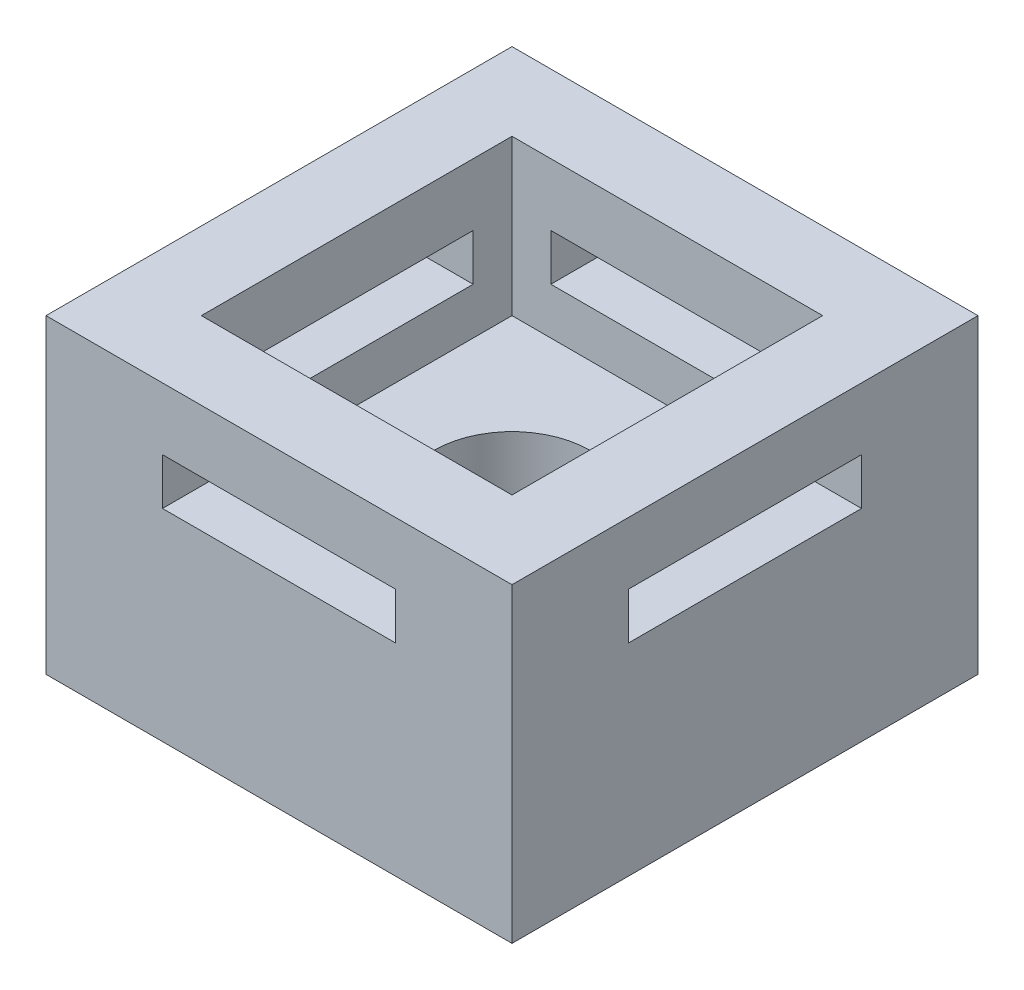
ISO-10303-21;
HEADER;
FILE_DESCRIPTION(('STEP AP214'),'2;1');
FILE_NAME('part.step','',(''),(''),'','','');
FILE_SCHEMA(('AUTOMOTIVE_DESIGN { 1 0 10303 214 1 1 1 1 }'));
ENDSEC;
DATA;
#1=APPLICATION_CONTEXT('core data for automotive mechanical design processes');
#2=APPLICATION_PROTOCOL_DEFINITION('international standard','automotive_design',2000,#1);
#3=PRODUCT_CONTEXT('',#1,'mechanical');
#4=PRODUCT('Part','Part','',(#3));
#5=PRODUCT_RELATED_PRODUCT_CATEGORY('part','',(#4));
#6=PRODUCT_DEFINITION_FORMATION('','',#4);
#7=PRODUCT_DEFINITION_CONTEXT('part definition',#1,'design');
#8=PRODUCT_DEFINITION('design','',#6,#7);
#9=PRODUCT_DEFINITION_SHAPE('','',#8);
#10=(LENGTH_UNIT() NAMED_UNIT(*) SI_UNIT(.MILLI.,.METRE.));
#11=(NAMED_UNIT(*) PLANE_ANGLE_UNIT() SI_UNIT($,.RADIAN.));
#12=(NAMED_UNIT(*) SI_UNIT($,.STERADIAN.) SOLID_ANGLE_UNIT());
#13=UNCERTAINTY_MEASURE_WITH_UNIT(LENGTH_MEASURE(1.E-05),#10,'distance_accuracy_value','');
#14=(GEOMETRIC_REPRESENTATION_CONTEXT(3) GLOBAL_UNCERTAINTY_ASSIGNED_CONTEXT((#13)) GLOBAL_UNIT_ASSIGNED_CONTEXT((#10,
#11,#12)) REPRESENTATION_CONTEXT('',''));
#15=CARTESIAN_POINT('',(0.,0.,0.));
#16=DIRECTION('',(0.,0.,1.));
#17=DIRECTION('',(1.,0.,0.));
#18=AXIS2_PLACEMENT_3D('',#15,#16,#17);
#19=CARTESIAN_POINT('',(7.62,10.16,-7.62));
#20=DIRECTION('',(0.,-1.,0.));
#21=DIRECTION('',(0.,0.,-1.));
#22=AXIS2_PLACEMENT_3D('',#19,#20,#21);
#23=CYLINDRICAL_SURFACE('',#22,2.54);
#24=CARTESIAN_POINT('',(7.62,0.,-7.62));
#25=DIRECTION('',(0.,1.,0.));
#26=DIRECTION('',(0.,0.,1.));
#27=AXIS2_PLACEMENT_3D('',#24,#25,#26);
#28=CIRCLE('',#27,2.54);
#29=CARTESIAN_POINT('',(7.62,0.,-5.08));
#30=VERTEX_POINT('',#29);
#31=EDGE_CURVE('E333',#30,#30,#28,.T.);
#32=ORIENTED_EDGE('',*,*,#31,.F.);
#33=EDGE_LOOP('',(#32));
#34=FACE_BOUND('',#33,.T.);
#35=CARTESIAN_POINT('',(7.62,5.08,-7.62));
#36=DIRECTION('',(0.,1.,0.));
#37=DIRECTION('',(0.,0.,1.));
#38=AXIS2_PLACEMENT_3D('',#35,#36,#37);
#39=CIRCLE('',#38,2.54);
#40=CARTESIAN_POINT('',(7.62,5.08,-5.08));
#41=VERTEX_POINT('',#40);
#42=EDGE_CURVE('E326',#41,#41,#39,.T.);
#43=ORIENTED_EDGE('',*,*,#42,.T.);
#44=EDGE_LOOP('',(#43));
#45=FACE_BOUND('',#44,.T.);
#46=ADVANCED_FACE('F33',(#34,#45),#23,.F.);
#47=CARTESIAN_POINT('',(0.,10.16,0.));
#48=DIRECTION('',(0.,-1.,0.));
#49=DIRECTION('',(0.,0.,-1.));
#50=AXIS2_PLACEMENT_3D('',#47,#48,#49);
#51=PLANE('',#50);
#52=DIRECTION('',(1.,0.,0.));
#53=VECTOR('',#52,1.);
#54=CARTESIAN_POINT('',(2.54,10.16,-2.54));
#55=LINE('',#54,#53);
#56=CARTESIAN_POINT('',(2.54,10.16,-2.54));
#57=VERTEX_POINT('',#56);
#58=CARTESIAN_POINT('',(12.7,10.16,-2.54));
#59=VERTEX_POINT('',#58);
#60=EDGE_CURVE('E316',#57,#59,#55,.T.);
#61=ORIENTED_EDGE('',*,*,#60,.F.);
#62=DIRECTION('',(0.,0.,1.));
#63=VECTOR('',#62,1.);
#64=CARTESIAN_POINT('',(2.54,10.16,-12.7));
#65=LINE('',#64,#63);
#66=CARTESIAN_POINT('',(2.54,10.16,-12.7));
#67=VERTEX_POINT('',#66);
#68=EDGE_CURVE('E300',#67,#57,#65,.T.);
#69=ORIENTED_EDGE('',*,*,#68,.F.);
#70=DIRECTION('',(-1.,0.,0.));
#71=VECTOR('',#70,1.);
#72=CARTESIAN_POINT('',(2.54,10.16,-12.7));
#73=LINE('',#72,#71);
#74=CARTESIAN_POINT('',(12.7,10.16,-12.7));
#75=VERTEX_POINT('',#74);
#76=EDGE_CURVE('E305',#75,#67,#73,.T.);
#77=ORIENTED_EDGE('',*,*,#76,.F.);
#78=DIRECTION('',(0.,0.,-1.));
#79=VECTOR('',#78,1.);
#80=CARTESIAN_POINT('',(12.7,10.16,-12.7));
#81=LINE('',#80,#79);
#82=EDGE_CURVE('E319',#59,#75,#81,.T.);
#83=ORIENTED_EDGE('',*,*,#82,.F.);
#84=EDGE_LOOP('',(#61,#69,#77,#83));
#85=FACE_BOUND('',#84,.T.);
#86=DIRECTION('',(0.,0.,1.));
#87=VECTOR('',#86,1.);
#88=CARTESIAN_POINT('',(0.,10.16,0.));
#89=LINE('',#88,#87);
#90=CARTESIAN_POINT('',(0.,10.16,-15.24));
#91=VERTEX_POINT('',#90);
#92=CARTESIAN_POINT('',(0.,10.16,0.));
#93=VERTEX_POINT('',#92);
#94=EDGE_CURVE('E337',#91,#93,#89,.T.);
#95=ORIENTED_EDGE('',*,*,#94,.T.);
#96=DIRECTION('',(1.,0.,0.));
#97=VECTOR('',#96,1.);
#98=CARTESIAN_POINT('',(0.,10.16,0.));
#99=LINE('',#98,#97);
#100=CARTESIAN_POINT('',(15.24,10.16,0.));
#101=VERTEX_POINT('',#100);
#102=EDGE_CURVE('E340',#93,#101,#99,.T.);
#103=ORIENTED_EDGE('',*,*,#102,.T.);
#104=DIRECTION('',(0.,0.,-1.));
#105=VECTOR('',#104,1.);
#106=CARTESIAN_POINT('',(15.24,10.16,0.));
#107=LINE('',#106,#105);
#108=CARTESIAN_POINT('',(15.24,10.16,-15.24));
#109=VERTEX_POINT('',#108);
#110=EDGE_CURVE('E343',#101,#109,#107,.T.);
#111=ORIENTED_EDGE('',*,*,#110,.T.);
#112=DIRECTION('',(-1.,0.,0.));
#113=VECTOR('',#112,1.);
#114=CARTESIAN_POINT('',(0.,10.16,-15.24));
#115=LINE('',#114,#113);
#116=EDGE_CURVE('E345',#109,#91,#115,.T.);
#117=ORIENTED_EDGE('',*,*,#116,.T.);
#118=EDGE_LOOP('',(#95,#103,#111,#117));
#119=FACE_BOUND('',#118,.T.);
#120=ADVANCED_FACE('F416',(#85,#119),#51,.F.);
#121=CARTESIAN_POINT('',(0.,0.,0.));
#122=DIRECTION('',(0.,-1.,0.));
#123=DIRECTION('',(0.,0.,-1.));
#124=AXIS2_PLACEMENT_3D('',#121,#122,#123);
#125=PLANE('',#124);
#126=DIRECTION('',(0.,0.,1.));
#127=VECTOR('',#126,1.);
#128=CARTESIAN_POINT('',(0.,0.,0.));
#129=LINE('',#128,#127);
#130=CARTESIAN_POINT('',(0.,0.,-15.24));
#131=VERTEX_POINT('',#130);
#132=CARTESIAN_POINT('',(0.,0.,0.));
#133=VERTEX_POINT('',#132);
#134=EDGE_CURVE('E336',#131,#133,#129,.T.);
#135=ORIENTED_EDGE('',*,*,#134,.F.);
#136=DIRECTION('',(-1.,0.,0.));
#137=VECTOR('',#136,1.);
#138=CARTESIAN_POINT('',(0.,0.,-15.24));
#139=LINE('',#138,#137);
#140=CARTESIAN_POINT('',(15.24,0.,-15.24));
#141=VERTEX_POINT('',#140);
#142=EDGE_CURVE('E341',#141,#131,#139,.T.);
#143=ORIENTED_EDGE('',*,*,#142,.F.);
#144=DIRECTION('',(0.,0.,-1.));
#145=VECTOR('',#144,1.);
#146=CARTESIAN_POINT('',(15.24,0.,0.));
#147=LINE('',#146,#145);
#148=CARTESIAN_POINT('',(15.24,0.,0.));
#149=VERTEX_POINT('',#148);
#150=EDGE_CURVE('E352',#149,#141,#147,.T.);
#151=ORIENTED_EDGE('',*,*,#150,.F.);
#152=DIRECTION('',(1.,0.,0.));
#153=VECTOR('',#152,1.);
#154=CARTESIAN_POINT('',(0.,0.,0.));
#155=LINE('',#154,#153);
#156=EDGE_CURVE('E350',#133,#149,#155,.T.);
#157=ORIENTED_EDGE('',*,*,#156,.F.);
#158=EDGE_LOOP('',(#135,#143,#151,#157));
#159=FACE_BOUND('',#158,.T.);
#160=ORIENTED_EDGE('',*,*,#31,.T.);
#161=EDGE_LOOP('',(#160));
#162=FACE_BOUND('',#161,.T.);
#163=ADVANCED_FACE('F422',(#159,#162),#125,.T.);
#164=CARTESIAN_POINT('',(0.,10.16,0.));
#165=DIRECTION('',(1.,0.,0.));
#166=DIRECTION('',(0.,0.,-1.));
#167=AXIS2_PLACEMENT_3D('',#164,#165,#166);
#168=PLANE('',#167);
#169=DIRECTION('',(0.,0.,1.));
#170=VECTOR('',#169,1.);
#171=CARTESIAN_POINT('',(0.,8.128,-3.81));
#172=LINE('',#171,#170);
#173=CARTESIAN_POINT('',(0.,8.128,-11.43));
#174=VERTEX_POINT('',#173);
#175=CARTESIAN_POINT('',(0.,8.128,-3.81));
#176=VERTEX_POINT('',#175);
#177=EDGE_CURVE('E218',#174,#176,#172,.T.);
#178=ORIENTED_EDGE('',*,*,#177,.T.);
#179=DIRECTION('',(0.,-1.,0.));
#180=VECTOR('',#179,1.);
#181=CARTESIAN_POINT('',(0.,8.128,-3.81));
#182=LINE('',#181,#180);
#183=CARTESIAN_POINT('',(0.,6.604,-3.81));
#184=VERTEX_POINT('',#183);
#185=EDGE_CURVE('E201',#176,#184,#182,.T.);
#186=ORIENTED_EDGE('',*,*,#185,.T.);
#187=DIRECTION('',(0.,0.,-1.));
#188=VECTOR('',#187,1.);
#189=CARTESIAN_POINT('',(0.,6.604,-3.81));
#190=LINE('',#189,#188);
#191=CARTESIAN_POINT('',(0.,6.604,-11.43));
#192=VERTEX_POINT('',#191);
#193=EDGE_CURVE('E211',#184,#192,#190,.T.);
#194=ORIENTED_EDGE('',*,*,#193,.T.);
#195=DIRECTION('',(0.,1.,0.));
#196=VECTOR('',#195,1.);
#197=CARTESIAN_POINT('',(0.,8.128,-11.43));
#198=LINE('',#197,#196);
#199=EDGE_CURVE('E48',#192,#174,#198,.T.);
#200=ORIENTED_EDGE('',*,*,#199,.T.);
#201=EDGE_LOOP('',(#178,#186,#194,#200));
#202=FACE_BOUND('',#201,.T.);
#203=ORIENTED_EDGE('',*,*,#134,.T.);
#204=DIRECTION('',(0.,-1.,0.));
#205=VECTOR('',#204,1.);
#206=CARTESIAN_POINT('',(0.,10.16,0.));
#207=LINE('',#206,#205);
#208=EDGE_CURVE('E363',#93,#133,#207,.T.);
#209=ORIENTED_EDGE('',*,*,#208,.F.);
#210=ORIENTED_EDGE('',*,*,#94,.F.);
#211=DIRECTION('',(0.,-1.,0.));
#212=VECTOR('',#211,1.);
#213=CARTESIAN_POINT('',(0.,10.16,-15.24));
#214=LINE('',#213,#212);
#215=EDGE_CURVE('E347',#91,#131,#214,.T.);
#216=ORIENTED_EDGE('',*,*,#215,.T.);
#217=EDGE_LOOP('',(#203,#209,#210,#216));
#218=FACE_BOUND('',#217,.T.);
#219=ADVANCED_FACE('F35',(#202,#218),#168,.F.);
#220=CARTESIAN_POINT('',(0.,10.16,0.));
#221=DIRECTION('',(0.,0.,-1.));
#222=DIRECTION('',(-1.,0.,0.));
#223=AXIS2_PLACEMENT_3D('',#220,#221,#222);
#224=PLANE('',#223);
#225=DIRECTION('',(1.,0.,0.));
#226=VECTOR('',#225,1.);
#227=CARTESIAN_POINT('',(3.81,6.604,0.));
#228=LINE('',#227,#226);
#229=CARTESIAN_POINT('',(3.81,6.604,0.));
#230=VERTEX_POINT('',#229);
#231=CARTESIAN_POINT('',(11.43,6.604,0.));
#232=VERTEX_POINT('',#231);
#233=EDGE_CURVE('E266',#230,#232,#228,.T.);
#234=ORIENTED_EDGE('',*,*,#233,.F.);
#235=DIRECTION('',(0.,-1.,0.));
#236=VECTOR('',#235,1.);
#237=CARTESIAN_POINT('',(3.81,8.128,0.));
#238=LINE('',#237,#236);
#239=CARTESIAN_POINT('',(3.81,8.128,0.));
#240=VERTEX_POINT('',#239);
#241=EDGE_CURVE('E250',#240,#230,#238,.T.);
#242=ORIENTED_EDGE('',*,*,#241,.F.);
#243=DIRECTION('',(-1.,0.,0.));
#244=VECTOR('',#243,1.);
#245=CARTESIAN_POINT('',(3.81,8.128,0.));
#246=LINE('',#245,#244);
#247=CARTESIAN_POINT('',(11.43,8.128,0.));
#248=VERTEX_POINT('',#247);
#249=EDGE_CURVE('E255',#248,#240,#246,.T.);
#250=ORIENTED_EDGE('',*,*,#249,.F.);
#251=DIRECTION('',(0.,1.,0.));
#252=VECTOR('',#251,1.);
#253=CARTESIAN_POINT('',(11.43,8.128,0.));
#254=LINE('',#253,#252);
#255=EDGE_CURVE('E269',#232,#248,#254,.T.);
#256=ORIENTED_EDGE('',*,*,#255,.F.);
#257=EDGE_LOOP('',(#234,#242,#250,#256));
#258=FACE_BOUND('',#257,.T.);
#259=ORIENTED_EDGE('',*,*,#156,.T.);
#260=DIRECTION('',(0.,-1.,0.));
#261=VECTOR('',#260,1.);
#262=CARTESIAN_POINT('',(15.24,10.16,0.));
#263=LINE('',#262,#261);
#264=EDGE_CURVE('E360',#101,#149,#263,.T.);
#265=ORIENTED_EDGE('',*,*,#264,.F.);
#266=ORIENTED_EDGE('',*,*,#102,.F.);
#267=ORIENTED_EDGE('',*,*,#208,.T.);
#268=EDGE_LOOP('',(#259,#265,#266,#267));
#269=FACE_BOUND('',#268,.T.);
#270=ADVANCED_FACE('F439',(#258,#269),#224,.F.);
#271=CARTESIAN_POINT('',(15.24,10.16,0.));
#272=DIRECTION('',(-1.,0.,0.));
#273=DIRECTION('',(0.,0.,1.));
#274=AXIS2_PLACEMENT_3D('',#271,#272,#273);
#275=PLANE('',#274);
#276=DIRECTION('',(0.,0.,-1.));
#277=VECTOR('',#276,1.);
#278=CARTESIAN_POINT('',(15.24,6.604,-3.81));
#279=LINE('',#278,#277);
#280=CARTESIAN_POINT('',(15.24,6.604,-3.81));
#281=VERTEX_POINT('',#280);
#282=CARTESIAN_POINT('',(15.24,6.604,-11.43));
#283=VERTEX_POINT('',#282);
#284=EDGE_CURVE('E228',#281,#283,#279,.T.);
#285=ORIENTED_EDGE('',*,*,#284,.F.);
#286=DIRECTION('',(0.,-1.,0.));
#287=VECTOR('',#286,1.);
#288=CARTESIAN_POINT('',(15.24,8.128,-3.81));
#289=LINE('',#288,#287);
#290=CARTESIAN_POINT('',(15.24,8.128,-3.81));
#291=VERTEX_POINT('',#290);
#292=EDGE_CURVE('E56',#291,#281,#289,.T.);
#293=ORIENTED_EDGE('',*,*,#292,.F.);
#294=DIRECTION('',(0.,0.,1.));
#295=VECTOR('',#294,1.);
#296=CARTESIAN_POINT('',(15.24,8.128,-3.81));
#297=LINE('',#296,#295);
#298=CARTESIAN_POINT('',(15.24,8.128,-11.43));
#299=VERTEX_POINT('',#298);
#300=EDGE_CURVE('E219',#299,#291,#297,.T.);
#301=ORIENTED_EDGE('',*,*,#300,.F.);
#302=DIRECTION('',(0.,1.,0.));
#303=VECTOR('',#302,1.);
#304=CARTESIAN_POINT('',(15.24,8.128,-11.43));
#305=LINE('',#304,#303);
#306=EDGE_CURVE('E222',#283,#299,#305,.T.);
#307=ORIENTED_EDGE('',*,*,#306,.F.);
#308=EDGE_LOOP('',(#285,#293,#301,#307));
#309=FACE_BOUND('',#308,.T.);
#310=ORIENTED_EDGE('',*,*,#150,.T.);
#311=DIRECTION('',(0.,-1.,0.));
#312=VECTOR('',#311,1.);
#313=CARTESIAN_POINT('',(15.24,10.16,-15.24));
#314=LINE('',#313,#312);
#315=EDGE_CURVE('E357',#109,#141,#314,.T.);
#316=ORIENTED_EDGE('',*,*,#315,.F.);
#317=ORIENTED_EDGE('',*,*,#110,.F.);
#318=ORIENTED_EDGE('',*,*,#264,.T.);
#319=EDGE_LOOP('',(#310,#316,#317,#318));
#320=FACE_BOUND('',#319,.T.);
#321=ADVANCED_FACE('F400',(#309,#320),#275,.F.);
#322=CARTESIAN_POINT('',(0.,10.16,-15.24));
#323=DIRECTION('',(0.,0.,1.));
#324=DIRECTION('',(1.,0.,0.));
#325=AXIS2_PLACEMENT_3D('',#322,#323,#324);
#326=PLANE('',#325);
#327=DIRECTION('',(-1.,0.,0.));
#328=VECTOR('',#327,1.);
#329=CARTESIAN_POINT('',(3.81,8.128,-15.24));
#330=LINE('',#329,#328);
#331=CARTESIAN_POINT('',(11.43,8.128,-15.24));
#332=VERTEX_POINT('',#331);
#333=CARTESIAN_POINT('',(3.81,8.128,-15.24));
#334=VERTEX_POINT('',#333);
#335=EDGE_CURVE('E261',#332,#334,#330,.T.);
#336=ORIENTED_EDGE('',*,*,#335,.T.);
#337=DIRECTION('',(0.,-1.,0.));
#338=VECTOR('',#337,1.);
#339=CARTESIAN_POINT('',(3.81,8.128,-15.24));
#340=LINE('',#339,#338);
#341=CARTESIAN_POINT('',(3.81,6.604,-15.24));
#342=VERTEX_POINT('',#341);
#343=EDGE_CURVE('E251',#334,#342,#340,.T.);
#344=ORIENTED_EDGE('',*,*,#343,.T.);
#345=DIRECTION('',(1.,0.,0.));
#346=VECTOR('',#345,1.);
#347=CARTESIAN_POINT('',(3.81,6.604,-15.24));
#348=LINE('',#347,#346);
#349=CARTESIAN_POINT('',(11.43,6.604,-15.24));
#350=VERTEX_POINT('',#349);
#351=EDGE_CURVE('E254',#342,#350,#348,.T.);
#352=ORIENTED_EDGE('',*,*,#351,.T.);
#353=DIRECTION('',(0.,1.,0.));
#354=VECTOR('',#353,1.);
#355=CARTESIAN_POINT('',(11.43,8.128,-15.24));
#356=LINE('',#355,#354);
#357=EDGE_CURVE('E258',#350,#332,#356,.T.);
#358=ORIENTED_EDGE('',*,*,#357,.T.);
#359=EDGE_LOOP('',(#336,#344,#352,#358));
#360=FACE_BOUND('',#359,.T.);
#361=ORIENTED_EDGE('',*,*,#142,.T.);
#362=ORIENTED_EDGE('',*,*,#215,.F.);
#363=ORIENTED_EDGE('',*,*,#116,.F.);
#364=ORIENTED_EDGE('',*,*,#315,.T.);
#365=EDGE_LOOP('',(#361,#362,#363,#364));
#366=FACE_BOUND('',#365,.T.);
#367=ADVANCED_FACE('F434',(#360,#366),#326,.F.);
#368=CARTESIAN_POINT('',(2.54,5.08,-12.7));
#369=DIRECTION('',(-1.,0.,0.));
#370=DIRECTION('',(0.,0.,1.));
#371=AXIS2_PLACEMENT_3D('',#368,#369,#370);
#372=PLANE('',#371);
#373=DIRECTION('',(0.,0.,1.));
#374=VECTOR('',#373,1.);
#375=CARTESIAN_POINT('',(2.54,6.604,-12.7));
#376=LINE('',#375,#374);
#377=CARTESIAN_POINT('',(2.54,6.604,-11.43));
#378=VERTEX_POINT('',#377);
#379=CARTESIAN_POINT('',(2.54,6.604,-3.81));
#380=VERTEX_POINT('',#379);
#381=EDGE_CURVE('E235',#378,#380,#376,.T.);
#382=ORIENTED_EDGE('',*,*,#381,.T.);
#383=DIRECTION('',(0.,1.,0.));
#384=VECTOR('',#383,1.);
#385=CARTESIAN_POINT('',(2.54,5.08,-3.81));
#386=LINE('',#385,#384);
#387=CARTESIAN_POINT('',(2.54,8.128,-3.81));
#388=VERTEX_POINT('',#387);
#389=EDGE_CURVE('E204',#380,#388,#386,.T.);
#390=ORIENTED_EDGE('',*,*,#389,.T.);
#391=DIRECTION('',(0.,0.,-1.));
#392=VECTOR('',#391,1.);
#393=CARTESIAN_POINT('',(2.54,8.128,-12.7));
#394=LINE('',#393,#392);
#395=CARTESIAN_POINT('',(2.54,8.128,-11.43));
#396=VERTEX_POINT('',#395);
#397=EDGE_CURVE('E246',#388,#396,#394,.T.);
#398=ORIENTED_EDGE('',*,*,#397,.T.);
#399=DIRECTION('',(0.,-1.,0.));
#400=VECTOR('',#399,1.);
#401=CARTESIAN_POINT('',(2.54,5.08,-11.43));
#402=LINE('',#401,#400);
#403=EDGE_CURVE('E243',#396,#378,#402,.T.);
#404=ORIENTED_EDGE('',*,*,#403,.T.);
#405=EDGE_LOOP('',(#382,#390,#398,#404));
#406=FACE_BOUND('',#405,.T.);
#407=ORIENTED_EDGE('',*,*,#68,.T.);
#408=DIRECTION('',(0.,1.,0.));
#409=VECTOR('',#408,1.);
#410=CARTESIAN_POINT('',(2.54,5.08,-2.54));
#411=LINE('',#410,#409);
#412=CARTESIAN_POINT('',(2.54,5.08,-2.54));
#413=VERTEX_POINT('',#412);
#414=EDGE_CURVE('E314',#413,#57,#411,.T.);
#415=ORIENTED_EDGE('',*,*,#414,.F.);
#416=DIRECTION('',(0.,0.,1.));
#417=VECTOR('',#416,1.);
#418=CARTESIAN_POINT('',(2.54,5.08,-12.7));
#419=LINE('',#418,#417);
#420=CARTESIAN_POINT('',(2.54,5.08,-12.7));
#421=VERTEX_POINT('',#420);
#422=EDGE_CURVE('E301',#421,#413,#419,.T.);
#423=ORIENTED_EDGE('',*,*,#422,.F.);
#424=DIRECTION('',(0.,1.,0.));
#425=VECTOR('',#424,1.);
#426=CARTESIAN_POINT('',(2.54,5.08,-12.7));
#427=LINE('',#426,#425);
#428=EDGE_CURVE('E324',#421,#67,#427,.T.);
#429=ORIENTED_EDGE('',*,*,#428,.T.);
#430=EDGE_LOOP('',(#407,#415,#423,#429));
#431=FACE_BOUND('',#430,.T.);
#432=ADVANCED_FACE('F428',(#406,#431),#372,.F.);
#433=CARTESIAN_POINT('',(2.54,5.08,-12.7));
#434=DIRECTION('',(0.,0.,-1.));
#435=DIRECTION('',(-1.,0.,0.));
#436=AXIS2_PLACEMENT_3D('',#433,#434,#435);
#437=PLANE('',#436);
#438=DIRECTION('',(-1.,0.,0.));
#439=VECTOR('',#438,1.);
#440=CARTESIAN_POINT('',(2.54,6.604,-12.7));
#441=LINE('',#440,#439);
#442=CARTESIAN_POINT('',(11.43,6.604,-12.7));
#443=VERTEX_POINT('',#442);
#444=CARTESIAN_POINT('',(3.81,6.604,-12.7));
#445=VERTEX_POINT('',#444);
#446=EDGE_CURVE('E277',#443,#445,#441,.T.);
#447=ORIENTED_EDGE('',*,*,#446,.T.);
#448=DIRECTION('',(0.,1.,0.));
#449=VECTOR('',#448,1.);
#450=CARTESIAN_POINT('',(3.81,5.08,-12.7));
#451=LINE('',#450,#449);
#452=CARTESIAN_POINT('',(3.81,8.128,-12.7));
#453=VERTEX_POINT('',#452);
#454=EDGE_CURVE('E297',#445,#453,#451,.T.);
#455=ORIENTED_EDGE('',*,*,#454,.T.);
#456=DIRECTION('',(1.,0.,0.));
#457=VECTOR('',#456,1.);
#458=CARTESIAN_POINT('',(2.54,8.128,-12.7));
#459=LINE('',#458,#457);
#460=CARTESIAN_POINT('',(11.43,8.128,-12.7));
#461=VERTEX_POINT('',#460);
#462=EDGE_CURVE('E294',#453,#461,#459,.T.);
#463=ORIENTED_EDGE('',*,*,#462,.T.);
#464=DIRECTION('',(0.,-1.,0.));
#465=VECTOR('',#464,1.);
#466=CARTESIAN_POINT('',(11.43,5.08,-12.7));
#467=LINE('',#466,#465);
#468=EDGE_CURVE('E291',#461,#443,#467,.T.);
#469=ORIENTED_EDGE('',*,*,#468,.T.);
#470=EDGE_LOOP('',(#447,#455,#463,#469));
#471=FACE_BOUND('',#470,.T.);
#472=ORIENTED_EDGE('',*,*,#76,.T.);
#473=ORIENTED_EDGE('',*,*,#428,.F.);
#474=DIRECTION('',(-1.,0.,0.));
#475=VECTOR('',#474,1.);
#476=CARTESIAN_POINT('',(2.54,5.08,-12.7));
#477=LINE('',#476,#475);
#478=CARTESIAN_POINT('',(12.7,5.08,-12.7));
#479=VERTEX_POINT('',#478);
#480=EDGE_CURVE('E311',#479,#421,#477,.T.);
#481=ORIENTED_EDGE('',*,*,#480,.F.);
#482=DIRECTION('',(0.,1.,0.));
#483=VECTOR('',#482,1.);
#484=CARTESIAN_POINT('',(12.7,5.08,-12.7));
#485=LINE('',#484,#483);
#486=EDGE_CURVE('E327',#479,#75,#485,.T.);
#487=ORIENTED_EDGE('',*,*,#486,.T.);
#488=EDGE_LOOP('',(#472,#473,#481,#487));
#489=FACE_BOUND('',#488,.T.);
#490=ADVANCED_FACE('F505',(#471,#489),#437,.F.);
#491=CARTESIAN_POINT('',(12.7,5.08,-12.7));
#492=DIRECTION('',(1.,0.,0.));
#493=DIRECTION('',(0.,0.,-1.));
#494=AXIS2_PLACEMENT_3D('',#491,#492,#493);
#495=PLANE('',#494);
#496=DIRECTION('',(0.,0.,1.));
#497=VECTOR('',#496,1.);
#498=CARTESIAN_POINT('',(12.7,8.128,-12.7));
#499=LINE('',#498,#497);
#500=CARTESIAN_POINT('',(12.7,8.128,-11.43));
#501=VERTEX_POINT('',#500);
#502=CARTESIAN_POINT('',(12.7,8.128,-3.81));
#503=VERTEX_POINT('',#502);
#504=EDGE_CURVE('E41',#501,#503,#499,.T.);
#505=ORIENTED_EDGE('',*,*,#504,.T.);
#506=DIRECTION('',(0.,-1.,0.));
#507=VECTOR('',#506,1.);
#508=CARTESIAN_POINT('',(12.7,5.08,-3.81));
#509=LINE('',#508,#507);
#510=CARTESIAN_POINT('',(12.7,6.604,-3.81));
#511=VERTEX_POINT('',#510);
#512=EDGE_CURVE('E11',#503,#511,#509,.T.);
#513=ORIENTED_EDGE('',*,*,#512,.T.);
#514=DIRECTION('',(0.,0.,-1.));
#515=VECTOR('',#514,1.);
#516=CARTESIAN_POINT('',(12.7,6.604,-12.7));
#517=LINE('',#516,#515);
#518=CARTESIAN_POINT('',(12.7,6.604,-11.43));
#519=VERTEX_POINT('',#518);
#520=EDGE_CURVE('E380',#511,#519,#517,.T.);
#521=ORIENTED_EDGE('',*,*,#520,.T.);
#522=DIRECTION('',(0.,1.,0.));
#523=VECTOR('',#522,1.);
#524=CARTESIAN_POINT('',(12.7,5.08,-11.43));
#525=LINE('',#524,#523);
#526=EDGE_CURVE('E383',#519,#501,#525,.T.);
#527=ORIENTED_EDGE('',*,*,#526,.T.);
#528=EDGE_LOOP('',(#505,#513,#521,#527));
#529=FACE_BOUND('',#528,.T.);
#530=ORIENTED_EDGE('',*,*,#82,.T.);
#531=ORIENTED_EDGE('',*,*,#486,.F.);
#532=DIRECTION('',(0.,0.,-1.));
#533=VECTOR('',#532,1.);
#534=CARTESIAN_POINT('',(12.7,5.08,-12.7));
#535=LINE('',#534,#533);
#536=CARTESIAN_POINT('',(12.7,5.08,-2.54));
#537=VERTEX_POINT('',#536);
#538=EDGE_CURVE('E308',#537,#479,#535,.T.);
#539=ORIENTED_EDGE('',*,*,#538,.F.);
#540=DIRECTION('',(0.,1.,0.));
#541=VECTOR('',#540,1.);
#542=CARTESIAN_POINT('',(12.7,5.08,-2.54));
#543=LINE('',#542,#541);
#544=EDGE_CURVE('E329',#537,#59,#543,.T.);
#545=ORIENTED_EDGE('',*,*,#544,.T.);
#546=EDGE_LOOP('',(#530,#531,#539,#545));
#547=FACE_BOUND('',#546,.T.);
#548=ADVANCED_FACE('F387',(#529,#547),#495,.F.);
#549=CARTESIAN_POINT('',(2.54,5.08,-2.54));
#550=DIRECTION('',(0.,0.,1.));
#551=DIRECTION('',(1.,0.,0.));
#552=AXIS2_PLACEMENT_3D('',#549,#550,#551);
#553=PLANE('',#552);
#554=DIRECTION('',(-1.,0.,0.));
#555=VECTOR('',#554,1.);
#556=CARTESIAN_POINT('',(2.54,8.128,-2.54));
#557=LINE('',#556,#555);
#558=CARTESIAN_POINT('',(11.43,8.128,-2.54));
#559=VERTEX_POINT('',#558);
#560=CARTESIAN_POINT('',(3.81,8.128,-2.54));
#561=VERTEX_POINT('',#560);
#562=EDGE_CURVE('E374',#559,#561,#557,.T.);
#563=ORIENTED_EDGE('',*,*,#562,.T.);
#564=DIRECTION('',(0.,-1.,0.));
#565=VECTOR('',#564,1.);
#566=CARTESIAN_POINT('',(3.81,5.08,-2.54));
#567=LINE('',#566,#565);
#568=CARTESIAN_POINT('',(3.81,6.604,-2.54));
#569=VERTEX_POINT('',#568);
#570=EDGE_CURVE('E377',#561,#569,#567,.T.);
#571=ORIENTED_EDGE('',*,*,#570,.T.);
#572=DIRECTION('',(1.,0.,0.));
#573=VECTOR('',#572,1.);
#574=CARTESIAN_POINT('',(2.54,6.604,-2.54));
#575=LINE('',#574,#573);
#576=CARTESIAN_POINT('',(11.43,6.604,-2.54));
#577=VERTEX_POINT('',#576);
#578=EDGE_CURVE('E366',#569,#577,#575,.T.);
#579=ORIENTED_EDGE('',*,*,#578,.T.);
#580=DIRECTION('',(0.,1.,0.));
#581=VECTOR('',#580,1.);
#582=CARTESIAN_POINT('',(11.43,5.08,-2.54));
#583=LINE('',#582,#581);
#584=EDGE_CURVE('E371',#577,#559,#583,.T.);
#585=ORIENTED_EDGE('',*,*,#584,.T.);
#586=EDGE_LOOP('',(#563,#571,#579,#585));
#587=FACE_BOUND('',#586,.T.);
#588=ORIENTED_EDGE('',*,*,#60,.T.);
#589=ORIENTED_EDGE('',*,*,#544,.F.);
#590=DIRECTION('',(1.,0.,0.));
#591=VECTOR('',#590,1.);
#592=CARTESIAN_POINT('',(2.54,5.08,-2.54));
#593=LINE('',#592,#591);
#594=EDGE_CURVE('E304',#413,#537,#593,.T.);
#595=ORIENTED_EDGE('',*,*,#594,.F.);
#596=ORIENTED_EDGE('',*,*,#414,.T.);
#597=EDGE_LOOP('',(#588,#589,#595,#596));
#598=FACE_BOUND('',#597,.T.);
#599=ADVANCED_FACE('F472',(#587,#598),#553,.F.);
#600=CARTESIAN_POINT('',(0.,5.08,0.));
#601=DIRECTION('',(0.,1.,0.));
#602=DIRECTION('',(0.,0.,1.));
#603=AXIS2_PLACEMENT_3D('',#600,#601,#602);
#604=PLANE('',#603);
#605=ORIENTED_EDGE('',*,*,#42,.F.);
#606=EDGE_LOOP('',(#605));
#607=FACE_BOUND('',#606,.T.);
#608=ORIENTED_EDGE('',*,*,#422,.T.);
#609=ORIENTED_EDGE('',*,*,#594,.T.);
#610=ORIENTED_EDGE('',*,*,#538,.T.);
#611=ORIENTED_EDGE('',*,*,#480,.T.);
#612=EDGE_LOOP('',(#608,#609,#610,#611));
#613=FACE_BOUND('',#612,.T.);
#614=ADVANCED_FACE('F487',(#607,#613),#604,.T.);
#615=CARTESIAN_POINT('',(3.81,6.604,-15.24));
#616=DIRECTION('',(0.,-1.,0.));
#617=DIRECTION('',(0.,0.,-1.));
#618=AXIS2_PLACEMENT_3D('',#615,#616,#617);
#619=PLANE('',#618);
#620=DIRECTION('',(0.,0.,1.));
#621=VECTOR('',#620,1.);
#622=CARTESIAN_POINT('',(3.81,6.604,-15.24));
#623=LINE('',#622,#621);
#624=EDGE_CURVE('E264',#569,#230,#623,.T.);
#625=ORIENTED_EDGE('',*,*,#624,.T.);
#626=ORIENTED_EDGE('',*,*,#233,.T.);
#627=DIRECTION('',(0.,0.,1.));
#628=VECTOR('',#627,1.);
#629=CARTESIAN_POINT('',(11.43,6.604,-15.24));
#630=LINE('',#629,#628);
#631=EDGE_CURVE('E286',#577,#232,#630,.T.);
#632=ORIENTED_EDGE('',*,*,#631,.F.);
#633=ORIENTED_EDGE('',*,*,#578,.F.);
#634=EDGE_LOOP('',(#625,#626,#632,#633));
#635=FACE_BOUND('',#634,.T.);
#636=ADVANCED_FACE('F465',(#635),#619,.F.);
#637=CARTESIAN_POINT('',(11.43,8.128,-15.24));
#638=DIRECTION('',(1.,0.,0.));
#639=DIRECTION('',(0.,0.,-1.));
#640=AXIS2_PLACEMENT_3D('',#637,#638,#639);
#641=PLANE('',#640);
#642=ORIENTED_EDGE('',*,*,#631,.T.);
#643=ORIENTED_EDGE('',*,*,#255,.T.);
#644=DIRECTION('',(0.,0.,1.));
#645=VECTOR('',#644,1.);
#646=CARTESIAN_POINT('',(11.43,8.128,-15.24));
#647=LINE('',#646,#645);
#648=EDGE_CURVE('E282',#559,#248,#647,.T.);
#649=ORIENTED_EDGE('',*,*,#648,.F.);
#650=ORIENTED_EDGE('',*,*,#584,.F.);
#651=EDGE_LOOP('',(#642,#643,#649,#650));
#652=FACE_BOUND('',#651,.T.);
#653=ADVANCED_FACE('F478',(#652),#641,.F.);
#654=CARTESIAN_POINT('',(3.81,8.128,-15.24));
#655=DIRECTION('',(0.,1.,0.));
#656=DIRECTION('',(0.,0.,1.));
#657=AXIS2_PLACEMENT_3D('',#654,#655,#656);
#658=PLANE('',#657);
#659=ORIENTED_EDGE('',*,*,#648,.T.);
#660=ORIENTED_EDGE('',*,*,#249,.T.);
#661=DIRECTION('',(0.,0.,1.));
#662=VECTOR('',#661,1.);
#663=CARTESIAN_POINT('',(3.81,8.128,-15.24));
#664=LINE('',#663,#662);
#665=EDGE_CURVE('E278',#561,#240,#664,.T.);
#666=ORIENTED_EDGE('',*,*,#665,.F.);
#667=ORIENTED_EDGE('',*,*,#562,.F.);
#668=EDGE_LOOP('',(#659,#660,#666,#667));
#669=FACE_BOUND('',#668,.T.);
#670=ADVANCED_FACE('F476',(#669),#658,.F.);
#671=CARTESIAN_POINT('',(3.81,8.128,-15.24));
#672=DIRECTION('',(-1.,0.,0.));
#673=DIRECTION('',(0.,-1.,0.));
#674=AXIS2_PLACEMENT_3D('',#671,#672,#673);
#675=PLANE('',#674);
#676=ORIENTED_EDGE('',*,*,#665,.T.);
#677=ORIENTED_EDGE('',*,*,#241,.T.);
#678=ORIENTED_EDGE('',*,*,#624,.F.);
#679=ORIENTED_EDGE('',*,*,#570,.F.);
#680=EDGE_LOOP('',(#676,#677,#678,#679));
#681=FACE_BOUND('',#680,.T.);
#682=ADVANCED_FACE('F469',(#681),#675,.F.);
#683=EDGE_CURVE('E287',#342,#445,#623,.T.);
#684=ORIENTED_EDGE('',*,*,#683,.F.);
#685=ORIENTED_EDGE('',*,*,#343,.F.);
#686=EDGE_CURVE('E274',#334,#453,#664,.T.);
#687=ORIENTED_EDGE('',*,*,#686,.T.);
#688=ORIENTED_EDGE('',*,*,#454,.F.);
#689=EDGE_LOOP('',(#684,#685,#687,#688));
#690=FACE_BOUND('',#689,.T.);
#691=ADVANCED_FACE('F497',(#690),#675,.F.);
#692=ORIENTED_EDGE('',*,*,#686,.F.);
#693=ORIENTED_EDGE('',*,*,#335,.F.);
#694=EDGE_CURVE('E279',#332,#461,#647,.T.);
#695=ORIENTED_EDGE('',*,*,#694,.T.);
#696=ORIENTED_EDGE('',*,*,#462,.F.);
#697=EDGE_LOOP('',(#692,#693,#695,#696));
#698=FACE_BOUND('',#697,.T.);
#699=ADVANCED_FACE('F486',(#698),#658,.F.);
#700=ORIENTED_EDGE('',*,*,#694,.F.);
#701=ORIENTED_EDGE('',*,*,#357,.F.);
#702=EDGE_CURVE('E283',#350,#443,#630,.T.);
#703=ORIENTED_EDGE('',*,*,#702,.T.);
#704=ORIENTED_EDGE('',*,*,#468,.F.);
#705=EDGE_LOOP('',(#700,#701,#703,#704));
#706=FACE_BOUND('',#705,.T.);
#707=ADVANCED_FACE('F481',(#706),#641,.F.);
#708=ORIENTED_EDGE('',*,*,#702,.F.);
#709=ORIENTED_EDGE('',*,*,#351,.F.);
#710=ORIENTED_EDGE('',*,*,#683,.T.);
#711=ORIENTED_EDGE('',*,*,#446,.F.);
#712=EDGE_LOOP('',(#708,#709,#710,#711));
#713=FACE_BOUND('',#712,.T.);
#714=ADVANCED_FACE('F489',(#713),#619,.F.);
#715=CARTESIAN_POINT('',(0.,6.604,-3.81));
#716=DIRECTION('',(0.,-1.,0.));
#717=DIRECTION('',(0.,0.,-1.));
#718=AXIS2_PLACEMENT_3D('',#715,#716,#717);
#719=PLANE('',#718);
#720=DIRECTION('',(1.,0.,0.));
#721=VECTOR('',#720,1.);
#722=CARTESIAN_POINT('',(0.,6.604,-3.81));
#723=LINE('',#722,#721);
#724=EDGE_CURVE('E208',#511,#281,#723,.T.);
#725=ORIENTED_EDGE('',*,*,#724,.T.);
#726=ORIENTED_EDGE('',*,*,#284,.T.);
#727=DIRECTION('',(1.,0.,0.));
#728=VECTOR('',#727,1.);
#729=CARTESIAN_POINT('',(0.,6.604,-11.43));
#730=LINE('',#729,#728);
#731=EDGE_CURVE('E207',#519,#283,#730,.T.);
#732=ORIENTED_EDGE('',*,*,#731,.F.);
#733=ORIENTED_EDGE('',*,*,#520,.F.);
#734=EDGE_LOOP('',(#725,#726,#732,#733));
#735=FACE_BOUND('',#734,.T.);
#736=ADVANCED_FACE('F403',(#735),#719,.F.);
#737=CARTESIAN_POINT('',(0.,8.128,-11.43));
#738=DIRECTION('',(0.,0.,-1.));
#739=DIRECTION('',(-1.,0.,0.));
#740=AXIS2_PLACEMENT_3D('',#737,#738,#739);
#741=PLANE('',#740);
#742=ORIENTED_EDGE('',*,*,#731,.T.);
#743=ORIENTED_EDGE('',*,*,#306,.T.);
#744=DIRECTION('',(1.,0.,0.));
#745=VECTOR('',#744,1.);
#746=CARTESIAN_POINT('',(0.,8.128,-11.43));
#747=LINE('',#746,#745);
#748=EDGE_CURVE('E240',#501,#299,#747,.T.);
#749=ORIENTED_EDGE('',*,*,#748,.F.);
#750=ORIENTED_EDGE('',*,*,#526,.F.);
#751=EDGE_LOOP('',(#742,#743,#749,#750));
#752=FACE_BOUND('',#751,.T.);
#753=ADVANCED_FACE('F395',(#752),#741,.F.);
#754=CARTESIAN_POINT('',(0.,8.128,-3.81));
#755=DIRECTION('',(0.,1.,0.));
#756=DIRECTION('',(0.,0.,1.));
#757=AXIS2_PLACEMENT_3D('',#754,#755,#756);
#758=PLANE('',#757);
#759=ORIENTED_EDGE('',*,*,#748,.T.);
#760=ORIENTED_EDGE('',*,*,#300,.T.);
#761=DIRECTION('',(1.,0.,0.));
#762=VECTOR('',#761,1.);
#763=CARTESIAN_POINT('',(0.,8.128,-3.81));
#764=LINE('',#763,#762);
#765=EDGE_CURVE('E236',#503,#291,#764,.T.);
#766=ORIENTED_EDGE('',*,*,#765,.F.);
#767=ORIENTED_EDGE('',*,*,#504,.F.);
#768=EDGE_LOOP('',(#759,#760,#766,#767));
#769=FACE_BOUND('',#768,.T.);
#770=ADVANCED_FACE('F393',(#769),#758,.F.);
#771=CARTESIAN_POINT('',(0.,8.128,-3.81));
#772=DIRECTION('',(0.,0.,1.));
#773=DIRECTION('',(1.,0.,0.));
#774=AXIS2_PLACEMENT_3D('',#771,#772,#773);
#775=PLANE('',#774);
#776=ORIENTED_EDGE('',*,*,#765,.T.);
#777=ORIENTED_EDGE('',*,*,#292,.T.);
#778=ORIENTED_EDGE('',*,*,#724,.F.);
#779=ORIENTED_EDGE('',*,*,#512,.F.);
#780=EDGE_LOOP('',(#776,#777,#778,#779));
#781=FACE_BOUND('',#780,.T.);
#782=ADVANCED_FACE('F404',(#781),#775,.F.);
#783=EDGE_CURVE('E196',#184,#380,#723,.T.);
#784=ORIENTED_EDGE('',*,*,#783,.F.);
#785=ORIENTED_EDGE('',*,*,#185,.F.);
#786=EDGE_CURVE('E233',#176,#388,#764,.T.);
#787=ORIENTED_EDGE('',*,*,#786,.T.);
#788=ORIENTED_EDGE('',*,*,#389,.F.);
#789=EDGE_LOOP('',(#784,#785,#787,#788));
#790=FACE_BOUND('',#789,.T.);
#791=ADVANCED_FACE('F198',(#790),#775,.F.);
#792=ORIENTED_EDGE('',*,*,#786,.F.);
#793=ORIENTED_EDGE('',*,*,#177,.F.);
#794=EDGE_CURVE('E237',#174,#396,#747,.T.);
#795=ORIENTED_EDGE('',*,*,#794,.T.);
#796=ORIENTED_EDGE('',*,*,#397,.F.);
#797=EDGE_LOOP('',(#792,#793,#795,#796));
#798=FACE_BOUND('',#797,.T.);
#799=ADVANCED_FACE('F411',(#798),#758,.F.);
#800=ORIENTED_EDGE('',*,*,#794,.F.);
#801=ORIENTED_EDGE('',*,*,#199,.F.);
#802=EDGE_CURVE('E213',#192,#378,#730,.T.);
#803=ORIENTED_EDGE('',*,*,#802,.T.);
#804=ORIENTED_EDGE('',*,*,#403,.F.);
#805=EDGE_LOOP('',(#800,#801,#803,#804));
#806=FACE_BOUND('',#805,.T.);
#807=ADVANCED_FACE('F616',(#806),#741,.F.);
#808=ORIENTED_EDGE('',*,*,#802,.F.);
#809=ORIENTED_EDGE('',*,*,#193,.F.);
#810=ORIENTED_EDGE('',*,*,#783,.T.);
#811=ORIENTED_EDGE('',*,*,#381,.F.);
#812=EDGE_LOOP('',(#808,#809,#810,#811));
#813=FACE_BOUND('',#812,.T.);
#814=ADVANCED_FACE('F212',(#813),#719,.F.);
#815=CLOSED_SHELL('',(#46,#120,#163,#219,#270,#321,#367,#432,#490,#548,#599,#614,#636,#653,#670,
#682,#691,#699,#707,#714,#736,#753,#770,#782,#791,#799,#807,#814));
#816=MANIFOLD_SOLID_BREP('B2',#815);
#817=ADVANCED_BREP_SHAPE_REPRESENTATION('',(#18,#816),#14);
#818=SHAPE_DEFINITION_REPRESENTATION(#9,#817);
ENDSEC;
END-ISO-10303-21;
